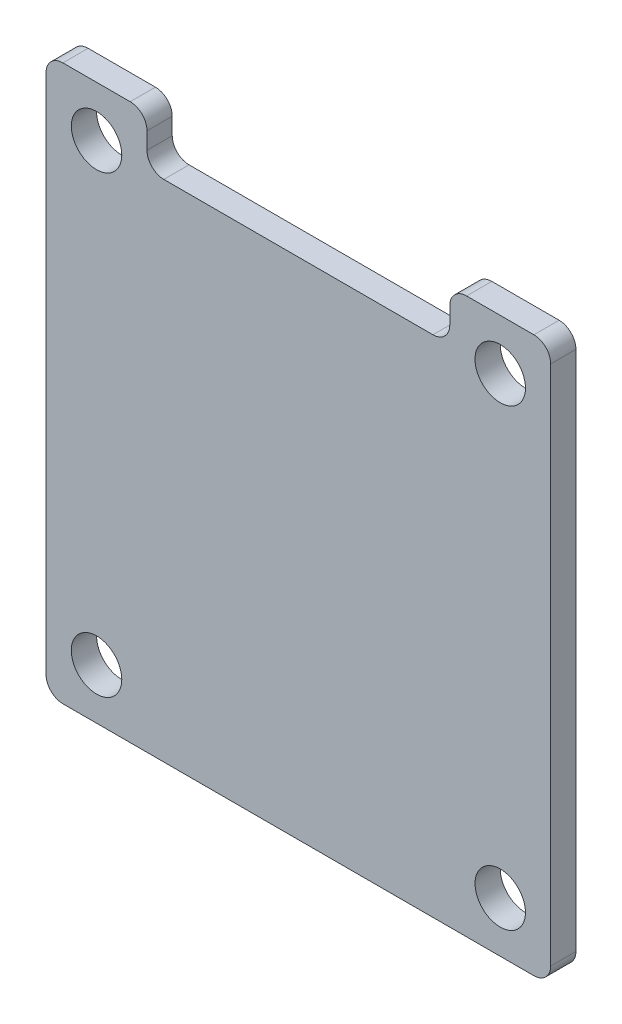
ISO-10303-21;
HEADER;
FILE_DESCRIPTION(('STEP AP214'),'2;1');
FILE_NAME('part.step','',(''),(''),'','','');
FILE_SCHEMA(('AUTOMOTIVE_DESIGN { 1 0 10303 214 1 1 1 1 }'));
ENDSEC;
DATA;
#1=APPLICATION_CONTEXT('core data for automotive mechanical design processes');
#2=APPLICATION_PROTOCOL_DEFINITION('international standard','automotive_design',2000,#1);
#3=PRODUCT_CONTEXT('',#1,'mechanical');
#4=PRODUCT('Part','Part','',(#3));
#5=PRODUCT_RELATED_PRODUCT_CATEGORY('part','',(#4));
#6=PRODUCT_DEFINITION_FORMATION('','',#4);
#7=PRODUCT_DEFINITION_CONTEXT('part definition',#1,'design');
#8=PRODUCT_DEFINITION('design','',#6,#7);
#9=PRODUCT_DEFINITION_SHAPE('','',#8);
#10=(LENGTH_UNIT() NAMED_UNIT(*) SI_UNIT(.MILLI.,.METRE.));
#11=(NAMED_UNIT(*) PLANE_ANGLE_UNIT() SI_UNIT($,.RADIAN.));
#12=(NAMED_UNIT(*) SI_UNIT($,.STERADIAN.) SOLID_ANGLE_UNIT());
#13=UNCERTAINTY_MEASURE_WITH_UNIT(LENGTH_MEASURE(1.E-05),#10,'distance_accuracy_value','');
#14=(GEOMETRIC_REPRESENTATION_CONTEXT(3) GLOBAL_UNCERTAINTY_ASSIGNED_CONTEXT((#13)) GLOBAL_UNIT_ASSIGNED_CONTEXT((#10,
#11,#12)) REPRESENTATION_CONTEXT('',''));
#15=CARTESIAN_POINT('',(0.,0.,0.));
#16=DIRECTION('',(0.,0.,1.));
#17=DIRECTION('',(1.,0.,0.));
#18=AXIS2_PLACEMENT_3D('',#15,#16,#17);
#19=CARTESIAN_POINT('',(0.,15.,1.5));
#20=DIRECTION('',(0.,1.,0.));
#21=DIRECTION('',(-1.,0.,0.));
#22=AXIS2_PLACEMENT_3D('',#19,#20,#21);
#23=PLANE('',#22);
#24=DIRECTION('',(1.,0.,0.));
#25=VECTOR('',#24,1.);
#26=CARTESIAN_POINT('',(0.,15.,0.));
#27=LINE('',#26,#25);
#28=CARTESIAN_POINT('',(-8.,15.,0.));
#29=VERTEX_POINT('',#28);
#30=CARTESIAN_POINT('',(8.,15.,0.));
#31=VERTEX_POINT('',#30);
#32=EDGE_CURVE('E265',#29,#31,#27,.T.);
#33=ORIENTED_EDGE('',*,*,#32,.F.);
#34=DIRECTION('',(0.,0.,-1.));
#35=VECTOR('',#34,1.);
#36=CARTESIAN_POINT('',(-8.,15.,1.5));
#37=LINE('',#36,#35);
#38=CARTESIAN_POINT('',(-8.,15.,1.5));
#39=VERTEX_POINT('',#38);
#40=EDGE_CURVE('E239',#29,#39,#37,.F.);
#41=ORIENTED_EDGE('',*,*,#40,.T.);
#42=DIRECTION('',(1.,0.,0.));
#43=VECTOR('',#42,1.);
#44=CARTESIAN_POINT('',(0.,15.,1.5));
#45=LINE('',#44,#43);
#46=CARTESIAN_POINT('',(8.,15.,1.5));
#47=VERTEX_POINT('',#46);
#48=EDGE_CURVE('E206',#39,#47,#45,.T.);
#49=ORIENTED_EDGE('',*,*,#48,.T.);
#50=DIRECTION('',(0.,0.,-1.));
#51=VECTOR('',#50,1.);
#52=CARTESIAN_POINT('',(8.,15.,0.));
#53=LINE('',#52,#51);
#54=EDGE_CURVE('E236',#47,#31,#53,.T.);
#55=ORIENTED_EDGE('',*,*,#54,.T.);
#56=EDGE_LOOP('',(#33,#41,#49,#55));
#57=FACE_BOUND('',#56,.T.);
#58=ADVANCED_FACE('F35',(#57),#23,.T.);
#59=CARTESIAN_POINT('',(-9.,0.,1.5));
#60=DIRECTION('',(-1.,0.,0.));
#61=DIRECTION('',(0.,0.,1.));
#62=AXIS2_PLACEMENT_3D('',#59,#60,#61);
#63=PLANE('',#62);
#64=DIRECTION('',(0.,1.,0.));
#65=VECTOR('',#64,1.);
#66=CARTESIAN_POINT('',(-9.,0.,0.));
#67=LINE('',#66,#65);
#68=CARTESIAN_POINT('',(-9.,16.,0.));
#69=VERTEX_POINT('',#68);
#70=CARTESIAN_POINT('',(-9.,17.,0.));
#71=VERTEX_POINT('',#70);
#72=EDGE_CURVE('E182',#69,#71,#67,.T.);
#73=ORIENTED_EDGE('',*,*,#72,.T.);
#74=DIRECTION('',(0.,0.,-1.));
#75=VECTOR('',#74,1.);
#76=CARTESIAN_POINT('',(-9.,17.,1.5));
#77=LINE('',#76,#75);
#78=CARTESIAN_POINT('',(-9.,17.,1.5));
#79=VERTEX_POINT('',#78);
#80=EDGE_CURVE('E234',#71,#79,#77,.F.);
#81=ORIENTED_EDGE('',*,*,#80,.T.);
#82=DIRECTION('',(0.,1.,0.));
#83=VECTOR('',#82,1.);
#84=CARTESIAN_POINT('',(-9.,0.,1.5));
#85=LINE('',#84,#83);
#86=CARTESIAN_POINT('',(-9.,16.,1.5));
#87=VERTEX_POINT('',#86);
#88=EDGE_CURVE('E281',#87,#79,#85,.T.);
#89=ORIENTED_EDGE('',*,*,#88,.F.);
#90=DIRECTION('',(0.,0.,-1.));
#91=VECTOR('',#90,1.);
#92=CARTESIAN_POINT('',(-9.,16.,1.5));
#93=LINE('',#92,#91);
#94=EDGE_CURVE('E231',#87,#69,#93,.T.);
#95=ORIENTED_EDGE('',*,*,#94,.T.);
#96=EDGE_LOOP('',(#73,#81,#89,#95));
#97=FACE_BOUND('',#96,.T.);
#98=ADVANCED_FACE('F314',(#97),#63,.F.);
#99=CARTESIAN_POINT('',(0.,18.,1.5));
#100=DIRECTION('',(0.,1.,0.));
#101=DIRECTION('',(0.,0.,1.));
#102=AXIS2_PLACEMENT_3D('',#99,#100,#101);
#103=PLANE('',#102);
#104=DIRECTION('',(1.,0.,0.));
#105=VECTOR('',#104,1.);
#106=CARTESIAN_POINT('',(0.,18.,0.));
#107=LINE('',#106,#105);
#108=CARTESIAN_POINT('',(-14.,18.,0.));
#109=VERTEX_POINT('',#108);
#110=CARTESIAN_POINT('',(-10.,18.,0.));
#111=VERTEX_POINT('',#110);
#112=EDGE_CURVE('E177',#109,#111,#107,.T.);
#113=ORIENTED_EDGE('',*,*,#112,.F.);
#114=DIRECTION('',(0.,0.,-1.));
#115=VECTOR('',#114,1.);
#116=CARTESIAN_POINT('',(-14.,18.,1.5));
#117=LINE('',#116,#115);
#118=CARTESIAN_POINT('',(-14.,18.,1.5));
#119=VERTEX_POINT('',#118);
#120=EDGE_CURVE('E154',#109,#119,#117,.F.);
#121=ORIENTED_EDGE('',*,*,#120,.T.);
#122=DIRECTION('',(1.,0.,0.));
#123=VECTOR('',#122,1.);
#124=CARTESIAN_POINT('',(0.,18.,1.5));
#125=LINE('',#124,#123);
#126=CARTESIAN_POINT('',(-10.,18.,1.5));
#127=VERTEX_POINT('',#126);
#128=EDGE_CURVE('E284',#119,#127,#125,.T.);
#129=ORIENTED_EDGE('',*,*,#128,.T.);
#130=DIRECTION('',(0.,0.,-1.));
#131=VECTOR('',#130,1.);
#132=CARTESIAN_POINT('',(-10.,18.,0.));
#133=LINE('',#132,#131);
#134=EDGE_CURVE('E159',#127,#111,#133,.T.);
#135=ORIENTED_EDGE('',*,*,#134,.T.);
#136=EDGE_LOOP('',(#113,#121,#129,#135));
#137=FACE_BOUND('',#136,.T.);
#138=ADVANCED_FACE('F322',(#137),#103,.T.);
#139=CARTESIAN_POINT('',(-15.,0.,1.5));
#140=DIRECTION('',(1.,0.,0.));
#141=DIRECTION('',(0.,1.,0.));
#142=AXIS2_PLACEMENT_3D('',#139,#140,#141);
#143=PLANE('',#142);
#144=DIRECTION('',(0.,-1.,0.));
#145=VECTOR('',#144,1.);
#146=CARTESIAN_POINT('',(-15.,0.,1.5));
#147=LINE('',#146,#145);
#148=CARTESIAN_POINT('',(-15.,17.,1.5));
#149=VERTEX_POINT('',#148);
#150=CARTESIAN_POINT('',(-15.,-14.,1.5));
#151=VERTEX_POINT('',#150);
#152=EDGE_CURVE('E169',#149,#151,#147,.T.);
#153=ORIENTED_EDGE('',*,*,#152,.F.);
#154=DIRECTION('',(0.,0.,-1.));
#155=VECTOR('',#154,1.);
#156=CARTESIAN_POINT('',(-15.,17.,0.));
#157=LINE('',#156,#155);
#158=CARTESIAN_POINT('',(-15.,17.,0.));
#159=VERTEX_POINT('',#158);
#160=EDGE_CURVE('E153',#149,#159,#157,.T.);
#161=ORIENTED_EDGE('',*,*,#160,.T.);
#162=DIRECTION('',(0.,-1.,0.));
#163=VECTOR('',#162,1.);
#164=CARTESIAN_POINT('',(-15.,0.,0.));
#165=LINE('',#164,#163);
#166=CARTESIAN_POINT('',(-15.,-14.,0.));
#167=VERTEX_POINT('',#166);
#168=EDGE_CURVE('E166',#159,#167,#165,.T.);
#169=ORIENTED_EDGE('',*,*,#168,.T.);
#170=DIRECTION('',(0.,0.,-1.));
#171=VECTOR('',#170,1.);
#172=CARTESIAN_POINT('',(-15.,-14.,1.5));
#173=LINE('',#172,#171);
#174=EDGE_CURVE('E171',#167,#151,#173,.F.);
#175=ORIENTED_EDGE('',*,*,#174,.T.);
#176=EDGE_LOOP('',(#153,#161,#169,#175));
#177=FACE_BOUND('',#176,.T.);
#178=ADVANCED_FACE('F165',(#177),#143,.F.);
#179=CARTESIAN_POINT('',(0.,-15.,1.5));
#180=DIRECTION('',(0.,1.,0.));
#181=DIRECTION('',(0.,0.,1.));
#182=AXIS2_PLACEMENT_3D('',#179,#180,#181);
#183=PLANE('',#182);
#184=DIRECTION('',(1.,0.,0.));
#185=VECTOR('',#184,1.);
#186=CARTESIAN_POINT('',(0.,-15.,0.));
#187=LINE('',#186,#185);
#188=CARTESIAN_POINT('',(-14.,-15.,0.));
#189=VERTEX_POINT('',#188);
#190=CARTESIAN_POINT('',(14.,-15.,0.));
#191=VERTEX_POINT('',#190);
#192=EDGE_CURVE('E176',#189,#191,#187,.T.);
#193=ORIENTED_EDGE('',*,*,#192,.T.);
#194=DIRECTION('',(0.,0.,-1.));
#195=VECTOR('',#194,1.);
#196=CARTESIAN_POINT('',(14.,-15.,1.5));
#197=LINE('',#196,#195);
#198=CARTESIAN_POINT('',(14.,-15.,1.5));
#199=VERTEX_POINT('',#198);
#200=EDGE_CURVE('E258',#191,#199,#197,.F.);
#201=ORIENTED_EDGE('',*,*,#200,.T.);
#202=DIRECTION('',(1.,0.,0.));
#203=VECTOR('',#202,1.);
#204=CARTESIAN_POINT('',(0.,-15.,1.5));
#205=LINE('',#204,#203);
#206=CARTESIAN_POINT('',(-14.,-15.,1.5));
#207=VERTEX_POINT('',#206);
#208=EDGE_CURVE('E290',#207,#199,#205,.T.);
#209=ORIENTED_EDGE('',*,*,#208,.F.);
#210=DIRECTION('',(0.,0.,-1.));
#211=VECTOR('',#210,1.);
#212=CARTESIAN_POINT('',(-14.,-15.,1.5));
#213=LINE('',#212,#211);
#214=EDGE_CURVE('E255',#207,#189,#213,.T.);
#215=ORIENTED_EDGE('',*,*,#214,.T.);
#216=EDGE_LOOP('',(#193,#201,#209,#215));
#217=FACE_BOUND('',#216,.T.);
#218=ADVANCED_FACE('F329',(#217),#183,.F.);
#219=CARTESIAN_POINT('',(15.,0.,1.5));
#220=DIRECTION('',(1.,0.,0.));
#221=DIRECTION('',(0.,1.,0.));
#222=AXIS2_PLACEMENT_3D('',#219,#220,#221);
#223=PLANE('',#222);
#224=DIRECTION('',(0.,-1.,0.));
#225=VECTOR('',#224,1.);
#226=CARTESIAN_POINT('',(15.,0.,0.));
#227=LINE('',#226,#225);
#228=CARTESIAN_POINT('',(15.,17.,0.));
#229=VERTEX_POINT('',#228);
#230=CARTESIAN_POINT('',(15.,-14.,0.));
#231=VERTEX_POINT('',#230);
#232=EDGE_CURVE('E180',#229,#231,#227,.T.);
#233=ORIENTED_EDGE('',*,*,#232,.F.);
#234=DIRECTION('',(0.,0.,-1.));
#235=VECTOR('',#234,1.);
#236=CARTESIAN_POINT('',(15.,17.,1.5));
#237=LINE('',#236,#235);
#238=CARTESIAN_POINT('',(15.,17.,1.5));
#239=VERTEX_POINT('',#238);
#240=EDGE_CURVE('E253',#229,#239,#237,.F.);
#241=ORIENTED_EDGE('',*,*,#240,.T.);
#242=DIRECTION('',(0.,-1.,0.));
#243=VECTOR('',#242,1.);
#244=CARTESIAN_POINT('',(15.,0.,1.5));
#245=LINE('',#244,#243);
#246=CARTESIAN_POINT('',(15.,-14.,1.5));
#247=VERTEX_POINT('',#246);
#248=EDGE_CURVE('E293',#239,#247,#245,.T.);
#249=ORIENTED_EDGE('',*,*,#248,.T.);
#250=DIRECTION('',(0.,0.,-1.));
#251=VECTOR('',#250,1.);
#252=CARTESIAN_POINT('',(15.,-14.,0.));
#253=LINE('',#252,#251);
#254=EDGE_CURVE('E250',#247,#231,#253,.T.);
#255=ORIENTED_EDGE('',*,*,#254,.T.);
#256=EDGE_LOOP('',(#233,#241,#249,#255));
#257=FACE_BOUND('',#256,.T.);
#258=ADVANCED_FACE('F369',(#257),#223,.T.);
#259=CARTESIAN_POINT('',(0.,18.,1.5));
#260=DIRECTION('',(0.,-1.,0.));
#261=DIRECTION('',(1.,0.,0.));
#262=AXIS2_PLACEMENT_3D('',#259,#260,#261);
#263=PLANE('',#262);
#264=DIRECTION('',(-1.,0.,0.));
#265=VECTOR('',#264,1.);
#266=CARTESIAN_POINT('',(0.,18.,0.));
#267=LINE('',#266,#265);
#268=CARTESIAN_POINT('',(14.,18.,0.));
#269=VERTEX_POINT('',#268);
#270=CARTESIAN_POINT('',(10.,18.,0.));
#271=VERTEX_POINT('',#270);
#272=EDGE_CURVE('E188',#269,#271,#267,.T.);
#273=ORIENTED_EDGE('',*,*,#272,.T.);
#274=DIRECTION('',(0.,0.,-1.));
#275=VECTOR('',#274,1.);
#276=CARTESIAN_POINT('',(10.,18.,1.5));
#277=LINE('',#276,#275);
#278=CARTESIAN_POINT('',(10.,18.,1.5));
#279=VERTEX_POINT('',#278);
#280=EDGE_CURVE('E248',#271,#279,#277,.F.);
#281=ORIENTED_EDGE('',*,*,#280,.T.);
#282=DIRECTION('',(-1.,0.,0.));
#283=VECTOR('',#282,1.);
#284=CARTESIAN_POINT('',(0.,18.,1.5));
#285=LINE('',#284,#283);
#286=CARTESIAN_POINT('',(14.,18.,1.5));
#287=VERTEX_POINT('',#286);
#288=EDGE_CURVE('E296',#287,#279,#285,.T.);
#289=ORIENTED_EDGE('',*,*,#288,.F.);
#290=DIRECTION('',(0.,0.,-1.));
#291=VECTOR('',#290,1.);
#292=CARTESIAN_POINT('',(14.,18.,0.));
#293=LINE('',#292,#291);
#294=EDGE_CURVE('E245',#287,#269,#293,.T.);
#295=ORIENTED_EDGE('',*,*,#294,.T.);
#296=EDGE_LOOP('',(#273,#281,#289,#295));
#297=FACE_BOUND('',#296,.T.);
#298=ADVANCED_FACE('F374',(#297),#263,.F.);
#299=CARTESIAN_POINT('',(-12.,-12.,1.5));
#300=DIRECTION('',(0.,0.,-1.));
#301=DIRECTION('',(-1.,0.,0.));
#302=AXIS2_PLACEMENT_3D('',#299,#300,#301);
#303=CYLINDRICAL_SURFACE('',#302,1.5);
#304=CARTESIAN_POINT('',(-12.,-12.,1.5));
#305=DIRECTION('',(0.,0.,1.));
#306=DIRECTION('',(1.,0.,0.));
#307=AXIS2_PLACEMENT_3D('',#304,#305,#306);
#308=CIRCLE('',#307,1.5);
#309=CARTESIAN_POINT('',(-10.5,-12.,1.5));
#310=VERTEX_POINT('',#309);
#311=EDGE_CURVE('E305',#310,#310,#308,.T.);
#312=ORIENTED_EDGE('',*,*,#311,.T.);
#313=EDGE_LOOP('',(#312));
#314=FACE_BOUND('',#313,.T.);
#315=CARTESIAN_POINT('',(-12.,-12.,0.));
#316=DIRECTION('',(0.,0.,1.));
#317=DIRECTION('',(1.,0.,0.));
#318=AXIS2_PLACEMENT_3D('',#315,#316,#317);
#319=CIRCLE('',#318,1.5);
#320=CARTESIAN_POINT('',(-10.5,-12.,0.));
#321=VERTEX_POINT('',#320);
#322=EDGE_CURVE('E200',#321,#321,#319,.T.);
#323=ORIENTED_EDGE('',*,*,#322,.F.);
#324=EDGE_LOOP('',(#323));
#325=FACE_BOUND('',#324,.T.);
#326=ADVANCED_FACE('F389',(#314,#325),#303,.F.);
#327=CARTESIAN_POINT('',(12.,-12.,1.5));
#328=DIRECTION('',(0.,0.,-1.));
#329=DIRECTION('',(-1.,0.,0.));
#330=AXIS2_PLACEMENT_3D('',#327,#328,#329);
#331=CYLINDRICAL_SURFACE('',#330,1.49958017829562);
#332=CARTESIAN_POINT('',(12.,-12.,1.5));
#333=DIRECTION('',(0.,0.,1.));
#334=DIRECTION('',(1.,0.,0.));
#335=AXIS2_PLACEMENT_3D('',#332,#333,#334);
#336=CIRCLE('',#335,1.49958017829562);
#337=CARTESIAN_POINT('',(13.4995801782956,-12.,1.5));
#338=VERTEX_POINT('',#337);
#339=EDGE_CURVE('E302',#338,#338,#336,.T.);
#340=ORIENTED_EDGE('',*,*,#339,.T.);
#341=EDGE_LOOP('',(#340));
#342=FACE_BOUND('',#341,.T.);
#343=CARTESIAN_POINT('',(12.,-12.,0.));
#344=DIRECTION('',(0.,0.,1.));
#345=DIRECTION('',(1.,0.,0.));
#346=AXIS2_PLACEMENT_3D('',#343,#344,#345);
#347=CIRCLE('',#346,1.49958017829562);
#348=CARTESIAN_POINT('',(13.4995801782956,-12.,0.));
#349=VERTEX_POINT('',#348);
#350=EDGE_CURVE('E197',#349,#349,#347,.T.);
#351=ORIENTED_EDGE('',*,*,#350,.F.);
#352=EDGE_LOOP('',(#351));
#353=FACE_BOUND('',#352,.T.);
#354=ADVANCED_FACE('F396',(#342,#353),#331,.F.);
#355=CARTESIAN_POINT('',(12.,15.,1.5));
#356=DIRECTION('',(0.,0.,-1.));
#357=DIRECTION('',(-1.,0.,0.));
#358=AXIS2_PLACEMENT_3D('',#355,#356,#357);
#359=CYLINDRICAL_SURFACE('',#358,1.5);
#360=CARTESIAN_POINT('',(12.,15.,1.5));
#361=DIRECTION('',(0.,0.,1.));
#362=DIRECTION('',(1.,0.,0.));
#363=AXIS2_PLACEMENT_3D('',#360,#361,#362);
#364=CIRCLE('',#363,1.5);
#365=CARTESIAN_POINT('',(13.5,15.,1.5));
#366=VERTEX_POINT('',#365);
#367=EDGE_CURVE('E299',#366,#366,#364,.T.);
#368=ORIENTED_EDGE('',*,*,#367,.T.);
#369=EDGE_LOOP('',(#368));
#370=FACE_BOUND('',#369,.T.);
#371=CARTESIAN_POINT('',(12.,15.,0.));
#372=DIRECTION('',(0.,0.,1.));
#373=DIRECTION('',(1.,0.,0.));
#374=AXIS2_PLACEMENT_3D('',#371,#372,#373);
#375=CIRCLE('',#374,1.5);
#376=CARTESIAN_POINT('',(13.5,15.,0.));
#377=VERTEX_POINT('',#376);
#378=EDGE_CURVE('E194',#377,#377,#375,.T.);
#379=ORIENTED_EDGE('',*,*,#378,.F.);
#380=EDGE_LOOP('',(#379));
#381=FACE_BOUND('',#380,.T.);
#382=ADVANCED_FACE('F393',(#370,#381),#359,.F.);
#383=CARTESIAN_POINT('',(9.,0.,1.5));
#384=DIRECTION('',(-1.,0.,0.));
#385=DIRECTION('',(0.,0.,1.));
#386=AXIS2_PLACEMENT_3D('',#383,#384,#385);
#387=PLANE('',#386);
#388=DIRECTION('',(0.,1.,0.));
#389=VECTOR('',#388,1.);
#390=CARTESIAN_POINT('',(9.,0.,0.));
#391=LINE('',#390,#389);
#392=CARTESIAN_POINT('',(9.,16.,0.));
#393=VERTEX_POINT('',#392);
#394=CARTESIAN_POINT('',(9.,17.,0.));
#395=VERTEX_POINT('',#394);
#396=EDGE_CURVE('E191',#393,#395,#391,.T.);
#397=ORIENTED_EDGE('',*,*,#396,.F.);
#398=DIRECTION('',(0.,0.,-1.));
#399=VECTOR('',#398,1.);
#400=CARTESIAN_POINT('',(9.,16.,1.5));
#401=LINE('',#400,#399);
#402=CARTESIAN_POINT('',(9.,16.,1.5));
#403=VERTEX_POINT('',#402);
#404=EDGE_CURVE('E57',#393,#403,#401,.F.);
#405=ORIENTED_EDGE('',*,*,#404,.T.);
#406=DIRECTION('',(0.,1.,0.));
#407=VECTOR('',#406,1.);
#408=CARTESIAN_POINT('',(9.,0.,1.5));
#409=LINE('',#408,#407);
#410=CARTESIAN_POINT('',(9.,17.,1.5));
#411=VERTEX_POINT('',#410);
#412=EDGE_CURVE('E278',#403,#411,#409,.T.);
#413=ORIENTED_EDGE('',*,*,#412,.T.);
#414=DIRECTION('',(0.,0.,-1.));
#415=VECTOR('',#414,1.);
#416=CARTESIAN_POINT('',(9.,17.,0.));
#417=LINE('',#416,#415);
#418=EDGE_CURVE('E241',#411,#395,#417,.T.);
#419=ORIENTED_EDGE('',*,*,#418,.T.);
#420=EDGE_LOOP('',(#397,#405,#413,#419));
#421=FACE_BOUND('',#420,.T.);
#422=ADVANCED_FACE('F268',(#421),#387,.T.);
#423=CARTESIAN_POINT('',(-12.,15.,1.5));
#424=DIRECTION('',(0.,0.,-1.));
#425=DIRECTION('',(-1.,0.,0.));
#426=AXIS2_PLACEMENT_3D('',#423,#424,#425);
#427=CYLINDRICAL_SURFACE('',#426,1.5);
#428=CARTESIAN_POINT('',(-12.,15.,1.5));
#429=DIRECTION('',(0.,0.,1.));
#430=DIRECTION('',(1.,0.,0.));
#431=AXIS2_PLACEMENT_3D('',#428,#429,#430);
#432=CIRCLE('',#431,1.5);
#433=CARTESIAN_POINT('',(-10.5,15.,1.5));
#434=VERTEX_POINT('',#433);
#435=EDGE_CURVE('E207',#434,#434,#432,.T.);
#436=ORIENTED_EDGE('',*,*,#435,.T.);
#437=EDGE_LOOP('',(#436));
#438=FACE_BOUND('',#437,.T.);
#439=CARTESIAN_POINT('',(-12.,15.,0.));
#440=DIRECTION('',(0.,0.,1.));
#441=DIRECTION('',(1.,0.,0.));
#442=AXIS2_PLACEMENT_3D('',#439,#440,#441);
#443=CIRCLE('',#442,1.5);
#444=CARTESIAN_POINT('',(-10.5,15.,0.));
#445=VERTEX_POINT('',#444);
#446=EDGE_CURVE('E203',#445,#445,#443,.T.);
#447=ORIENTED_EDGE('',*,*,#446,.F.);
#448=EDGE_LOOP('',(#447));
#449=FACE_BOUND('',#448,.T.);
#450=ADVANCED_FACE('F392',(#438,#449),#427,.F.);
#451=CARTESIAN_POINT('',(0.,0.,1.5));
#452=DIRECTION('',(0.,0.,1.));
#453=DIRECTION('',(1.,0.,0.));
#454=AXIS2_PLACEMENT_3D('',#451,#452,#453);
#455=PLANE('',#454);
#456=ORIENTED_EDGE('',*,*,#128,.F.);
#457=CARTESIAN_POINT('',(-14.,17.,1.5));
#458=DIRECTION('',(0.,0.,1.));
#459=DIRECTION('',(1.,0.,0.));
#460=AXIS2_PLACEMENT_3D('',#457,#458,#459);
#461=CIRCLE('',#460,1.);
#462=EDGE_CURVE('E229',#119,#149,#461,.T.);
#463=ORIENTED_EDGE('',*,*,#462,.T.);
#464=ORIENTED_EDGE('',*,*,#152,.T.);
#465=CARTESIAN_POINT('',(-14.,-14.,1.5));
#466=DIRECTION('',(0.,0.,1.));
#467=DIRECTION('',(1.,0.,0.));
#468=AXIS2_PLACEMENT_3D('',#465,#466,#467);
#469=CIRCLE('',#468,1.);
#470=EDGE_CURVE('E220',#151,#207,#469,.T.);
#471=ORIENTED_EDGE('',*,*,#470,.T.);
#472=ORIENTED_EDGE('',*,*,#208,.T.);
#473=CARTESIAN_POINT('',(14.,-14.,1.5));
#474=DIRECTION('',(0.,0.,1.));
#475=DIRECTION('',(1.,0.,0.));
#476=AXIS2_PLACEMENT_3D('',#473,#474,#475);
#477=CIRCLE('',#476,1.);
#478=EDGE_CURVE('E222',#199,#247,#477,.T.);
#479=ORIENTED_EDGE('',*,*,#478,.T.);
#480=ORIENTED_EDGE('',*,*,#248,.F.);
#481=CARTESIAN_POINT('',(14.,17.,1.5));
#482=DIRECTION('',(0.,0.,1.));
#483=DIRECTION('',(1.,0.,0.));
#484=AXIS2_PLACEMENT_3D('',#481,#482,#483);
#485=CIRCLE('',#484,1.);
#486=EDGE_CURVE('E224',#239,#287,#485,.T.);
#487=ORIENTED_EDGE('',*,*,#486,.T.);
#488=ORIENTED_EDGE('',*,*,#288,.T.);
#489=CARTESIAN_POINT('',(10.,17.,1.5));
#490=DIRECTION('',(0.,0.,1.));
#491=DIRECTION('',(1.,0.,0.));
#492=AXIS2_PLACEMENT_3D('',#489,#490,#491);
#493=CIRCLE('',#492,1.);
#494=EDGE_CURVE('E50',#279,#411,#493,.T.);
#495=ORIENTED_EDGE('',*,*,#494,.T.);
#496=ORIENTED_EDGE('',*,*,#412,.F.);
#497=CARTESIAN_POINT('',(8.,16.,1.5));
#498=DIRECTION('',(0.,0.,1.));
#499=DIRECTION('',(1.,0.,0.));
#500=AXIS2_PLACEMENT_3D('',#497,#498,#499);
#501=CIRCLE('',#500,1.);
#502=EDGE_CURVE('E11',#403,#47,#501,.F.);
#503=ORIENTED_EDGE('',*,*,#502,.T.);
#504=ORIENTED_EDGE('',*,*,#48,.F.);
#505=CARTESIAN_POINT('',(-8.,16.,1.5));
#506=DIRECTION('',(0.,0.,1.));
#507=DIRECTION('',(1.,0.,0.));
#508=AXIS2_PLACEMENT_3D('',#505,#506,#507);
#509=CIRCLE('',#508,1.);
#510=EDGE_CURVE('E262',#39,#87,#509,.F.);
#511=ORIENTED_EDGE('',*,*,#510,.T.);
#512=ORIENTED_EDGE('',*,*,#88,.T.);
#513=CARTESIAN_POINT('',(-10.,17.,1.5));
#514=DIRECTION('',(0.,0.,1.));
#515=DIRECTION('',(1.,0.,0.));
#516=AXIS2_PLACEMENT_3D('',#513,#514,#515);
#517=CIRCLE('',#516,1.);
#518=EDGE_CURVE('E227',#79,#127,#517,.T.);
#519=ORIENTED_EDGE('',*,*,#518,.T.);
#520=EDGE_LOOP('',(#456,#463,#464,#471,#472,#479,#480,#487,#488,#495,#496,#503,#504,#511,#512,#519));
#521=FACE_BOUND('',#520,.T.);
#522=ORIENTED_EDGE('',*,*,#367,.F.);
#523=EDGE_LOOP('',(#522));
#524=FACE_BOUND('',#523,.T.);
#525=ORIENTED_EDGE('',*,*,#339,.F.);
#526=EDGE_LOOP('',(#525));
#527=FACE_BOUND('',#526,.T.);
#528=ORIENTED_EDGE('',*,*,#311,.F.);
#529=EDGE_LOOP('',(#528));
#530=FACE_BOUND('',#529,.T.);
#531=ORIENTED_EDGE('',*,*,#435,.F.);
#532=EDGE_LOOP('',(#531));
#533=FACE_BOUND('',#532,.T.);
#534=ADVANCED_FACE('F275',(#521,#524,#527,#530,#533),#455,.T.);
#535=CARTESIAN_POINT('',(0.,0.,0.));
#536=DIRECTION('',(0.,0.,1.));
#537=DIRECTION('',(1.,0.,0.));
#538=AXIS2_PLACEMENT_3D('',#535,#536,#537);
#539=PLANE('',#538);
#540=ORIENTED_EDGE('',*,*,#168,.F.);
#541=CARTESIAN_POINT('',(-14.,17.,0.));
#542=DIRECTION('',(0.,0.,1.));
#543=DIRECTION('',(1.,0.,0.));
#544=AXIS2_PLACEMENT_3D('',#541,#542,#543);
#545=CIRCLE('',#544,1.);
#546=EDGE_CURVE('E149',#159,#109,#545,.F.);
#547=ORIENTED_EDGE('',*,*,#546,.T.);
#548=ORIENTED_EDGE('',*,*,#112,.T.);
#549=CARTESIAN_POINT('',(-10.,17.,0.));
#550=DIRECTION('',(0.,0.,1.));
#551=DIRECTION('',(1.,0.,0.));
#552=AXIS2_PLACEMENT_3D('',#549,#550,#551);
#553=CIRCLE('',#552,1.);
#554=EDGE_CURVE('E160',#111,#71,#553,.F.);
#555=ORIENTED_EDGE('',*,*,#554,.T.);
#556=ORIENTED_EDGE('',*,*,#72,.F.);
#557=CARTESIAN_POINT('',(-8.,16.,0.));
#558=DIRECTION('',(0.,0.,1.));
#559=DIRECTION('',(1.,0.,0.));
#560=AXIS2_PLACEMENT_3D('',#557,#558,#559);
#561=CIRCLE('',#560,1.);
#562=EDGE_CURVE('E260',#69,#29,#561,.T.);
#563=ORIENTED_EDGE('',*,*,#562,.T.);
#564=ORIENTED_EDGE('',*,*,#32,.T.);
#565=CARTESIAN_POINT('',(8.,16.,0.));
#566=DIRECTION('',(0.,0.,1.));
#567=DIRECTION('',(1.,0.,0.));
#568=AXIS2_PLACEMENT_3D('',#565,#566,#567);
#569=CIRCLE('',#568,1.);
#570=EDGE_CURVE('E43',#31,#393,#569,.T.);
#571=ORIENTED_EDGE('',*,*,#570,.T.);
#572=ORIENTED_EDGE('',*,*,#396,.T.);
#573=CARTESIAN_POINT('',(10.,17.,0.));
#574=DIRECTION('',(0.,0.,1.));
#575=DIRECTION('',(1.,0.,0.));
#576=AXIS2_PLACEMENT_3D('',#573,#574,#575);
#577=CIRCLE('',#576,1.);
#578=EDGE_CURVE('E214',#395,#271,#577,.F.);
#579=ORIENTED_EDGE('',*,*,#578,.T.);
#580=ORIENTED_EDGE('',*,*,#272,.F.);
#581=CARTESIAN_POINT('',(14.,17.,0.));
#582=DIRECTION('',(0.,0.,1.));
#583=DIRECTION('',(1.,0.,0.));
#584=AXIS2_PLACEMENT_3D('',#581,#582,#583);
#585=CIRCLE('',#584,1.);
#586=EDGE_CURVE('E212',#269,#229,#585,.F.);
#587=ORIENTED_EDGE('',*,*,#586,.T.);
#588=ORIENTED_EDGE('',*,*,#232,.T.);
#589=CARTESIAN_POINT('',(14.,-14.,0.));
#590=DIRECTION('',(0.,0.,1.));
#591=DIRECTION('',(1.,0.,0.));
#592=AXIS2_PLACEMENT_3D('',#589,#590,#591);
#593=CIRCLE('',#592,1.);
#594=EDGE_CURVE('E210',#231,#191,#593,.F.);
#595=ORIENTED_EDGE('',*,*,#594,.T.);
#596=ORIENTED_EDGE('',*,*,#192,.F.);
#597=CARTESIAN_POINT('',(-14.,-14.,0.));
#598=DIRECTION('',(0.,0.,1.));
#599=DIRECTION('',(1.,0.,0.));
#600=AXIS2_PLACEMENT_3D('',#597,#598,#599);
#601=CIRCLE('',#600,1.);
#602=EDGE_CURVE('E170',#189,#167,#601,.F.);
#603=ORIENTED_EDGE('',*,*,#602,.T.);
#604=EDGE_LOOP('',(#540,#547,#548,#555,#556,#563,#564,#571,#572,#579,#580,#587,#588,#595,#596,#603));
#605=FACE_BOUND('',#604,.T.);
#606=ORIENTED_EDGE('',*,*,#378,.T.);
#607=EDGE_LOOP('',(#606));
#608=FACE_BOUND('',#607,.T.);
#609=ORIENTED_EDGE('',*,*,#350,.T.);
#610=EDGE_LOOP('',(#609));
#611=FACE_BOUND('',#610,.T.);
#612=ORIENTED_EDGE('',*,*,#322,.T.);
#613=EDGE_LOOP('',(#612));
#614=FACE_BOUND('',#613,.T.);
#615=ORIENTED_EDGE('',*,*,#446,.T.);
#616=EDGE_LOOP('',(#615));
#617=FACE_BOUND('',#616,.T.);
#618=ADVANCED_FACE('F173',(#605,#608,#611,#614,#617),#539,.F.);
#619=CARTESIAN_POINT('',(-14.,17.,1.5));
#620=DIRECTION('',(0.,0.,1.));
#621=DIRECTION('',(1.,0.,0.));
#622=AXIS2_PLACEMENT_3D('',#619,#620,#621);
#623=CYLINDRICAL_SURFACE('',#622,1.);
#624=ORIENTED_EDGE('',*,*,#462,.F.);
#625=ORIENTED_EDGE('',*,*,#120,.F.);
#626=ORIENTED_EDGE('',*,*,#546,.F.);
#627=ORIENTED_EDGE('',*,*,#160,.F.);
#628=EDGE_LOOP('',(#624,#625,#626,#627));
#629=FACE_BOUND('',#628,.T.);
#630=ADVANCED_FACE('F152',(#629),#623,.T.);
#631=CARTESIAN_POINT('',(-10.,17.,1.5));
#632=DIRECTION('',(0.,0.,1.));
#633=DIRECTION('',(1.,0.,0.));
#634=AXIS2_PLACEMENT_3D('',#631,#632,#633);
#635=CYLINDRICAL_SURFACE('',#634,1.);
#636=ORIENTED_EDGE('',*,*,#518,.F.);
#637=ORIENTED_EDGE('',*,*,#80,.F.);
#638=ORIENTED_EDGE('',*,*,#554,.F.);
#639=ORIENTED_EDGE('',*,*,#134,.F.);
#640=EDGE_LOOP('',(#636,#637,#638,#639));
#641=FACE_BOUND('',#640,.T.);
#642=ADVANCED_FACE('F319',(#641),#635,.T.);
#643=CARTESIAN_POINT('',(-8.,16.,1.5));
#644=DIRECTION('',(0.,0.,-1.));
#645=DIRECTION('',(-1.,0.,0.));
#646=AXIS2_PLACEMENT_3D('',#643,#644,#645);
#647=CYLINDRICAL_SURFACE('',#646,1.);
#648=ORIENTED_EDGE('',*,*,#510,.F.);
#649=ORIENTED_EDGE('',*,*,#40,.F.);
#650=ORIENTED_EDGE('',*,*,#562,.F.);
#651=ORIENTED_EDGE('',*,*,#94,.F.);
#652=EDGE_LOOP('',(#648,#649,#650,#651));
#653=FACE_BOUND('',#652,.T.);
#654=ADVANCED_FACE('F341',(#653),#647,.F.);
#655=CARTESIAN_POINT('',(8.,16.,1.5));
#656=DIRECTION('',(0.,0.,1.));
#657=DIRECTION('',(1.,0.,0.));
#658=AXIS2_PLACEMENT_3D('',#655,#656,#657);
#659=CYLINDRICAL_SURFACE('',#658,1.);
#660=ORIENTED_EDGE('',*,*,#502,.F.);
#661=ORIENTED_EDGE('',*,*,#404,.F.);
#662=ORIENTED_EDGE('',*,*,#570,.F.);
#663=ORIENTED_EDGE('',*,*,#54,.F.);
#664=EDGE_LOOP('',(#660,#661,#662,#663));
#665=FACE_BOUND('',#664,.T.);
#666=ADVANCED_FACE('F271',(#665),#659,.F.);
#667=CARTESIAN_POINT('',(10.,17.,1.5));
#668=DIRECTION('',(0.,0.,1.));
#669=DIRECTION('',(1.,0.,0.));
#670=AXIS2_PLACEMENT_3D('',#667,#668,#669);
#671=CYLINDRICAL_SURFACE('',#670,1.);
#672=ORIENTED_EDGE('',*,*,#494,.F.);
#673=ORIENTED_EDGE('',*,*,#280,.F.);
#674=ORIENTED_EDGE('',*,*,#578,.F.);
#675=ORIENTED_EDGE('',*,*,#418,.F.);
#676=EDGE_LOOP('',(#672,#673,#674,#675));
#677=FACE_BOUND('',#676,.T.);
#678=ADVANCED_FACE('F347',(#677),#671,.T.);
#679=CARTESIAN_POINT('',(14.,17.,1.5));
#680=DIRECTION('',(0.,0.,1.));
#681=DIRECTION('',(1.,0.,0.));
#682=AXIS2_PLACEMENT_3D('',#679,#680,#681);
#683=CYLINDRICAL_SURFACE('',#682,1.);
#684=ORIENTED_EDGE('',*,*,#486,.F.);
#685=ORIENTED_EDGE('',*,*,#240,.F.);
#686=ORIENTED_EDGE('',*,*,#586,.F.);
#687=ORIENTED_EDGE('',*,*,#294,.F.);
#688=EDGE_LOOP('',(#684,#685,#686,#687));
#689=FACE_BOUND('',#688,.T.);
#690=ADVANCED_FACE('F350',(#689),#683,.T.);
#691=CARTESIAN_POINT('',(14.,-14.,1.5));
#692=DIRECTION('',(0.,0.,1.));
#693=DIRECTION('',(1.,0.,0.));
#694=AXIS2_PLACEMENT_3D('',#691,#692,#693);
#695=CYLINDRICAL_SURFACE('',#694,1.);
#696=ORIENTED_EDGE('',*,*,#478,.F.);
#697=ORIENTED_EDGE('',*,*,#200,.F.);
#698=ORIENTED_EDGE('',*,*,#594,.F.);
#699=ORIENTED_EDGE('',*,*,#254,.F.);
#700=EDGE_LOOP('',(#696,#697,#698,#699));
#701=FACE_BOUND('',#700,.T.);
#702=ADVANCED_FACE('F353',(#701),#695,.T.);
#703=CARTESIAN_POINT('',(-14.,-14.,1.5));
#704=DIRECTION('',(0.,0.,-1.));
#705=DIRECTION('',(-1.,0.,0.));
#706=AXIS2_PLACEMENT_3D('',#703,#704,#705);
#707=CYLINDRICAL_SURFACE('',#706,1.);
#708=ORIENTED_EDGE('',*,*,#470,.F.);
#709=ORIENTED_EDGE('',*,*,#174,.F.);
#710=ORIENTED_EDGE('',*,*,#602,.F.);
#711=ORIENTED_EDGE('',*,*,#214,.F.);
#712=EDGE_LOOP('',(#708,#709,#710,#711));
#713=FACE_BOUND('',#712,.T.);
#714=ADVANCED_FACE('F37',(#713),#707,.T.);
#715=CLOSED_SHELL('',(#58,#98,#138,#178,#218,#258,#298,#326,#354,#382,#422,#450,#534,#618,#630,
#642,#654,#666,#678,#690,#702,#714));
#716=MANIFOLD_SOLID_BREP('B2',#715);
#717=ADVANCED_BREP_SHAPE_REPRESENTATION('',(#18,#716),#14);
#718=SHAPE_DEFINITION_REPRESENTATION(#9,#717);
ENDSEC;
END-ISO-10303-21;
